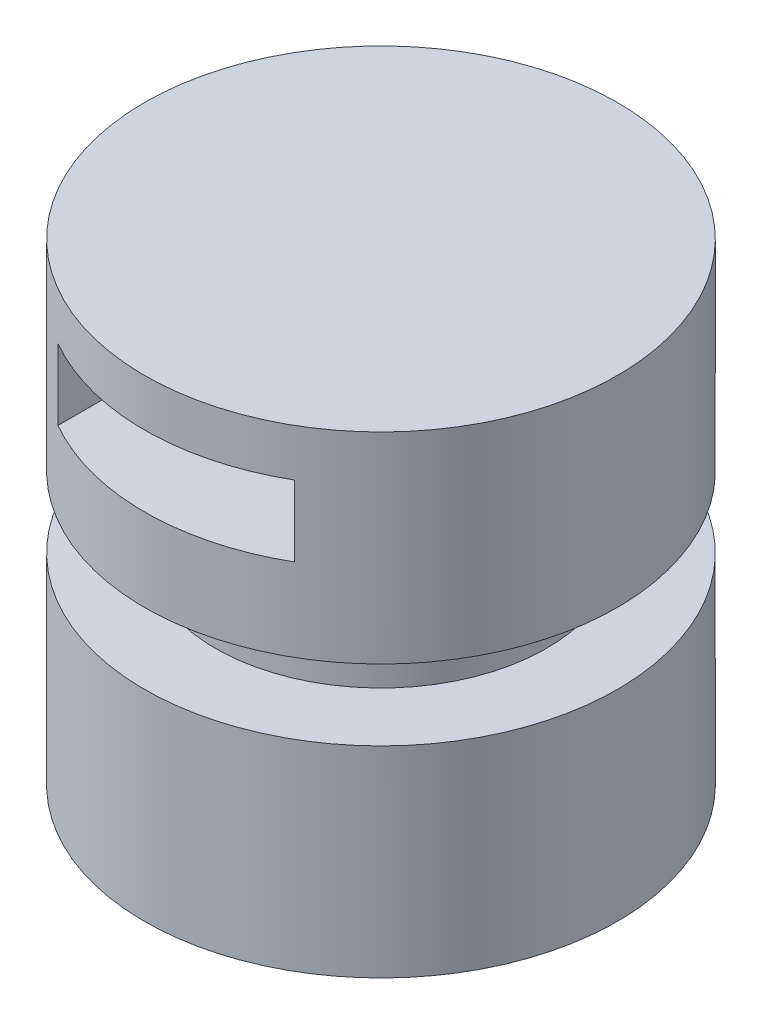
ISO-10303-21;
HEADER;
FILE_DESCRIPTION(('STEP AP214'),'2;1');
FILE_NAME('part.step','',(''),(''),'','','');
FILE_SCHEMA(('AUTOMOTIVE_DESIGN { 1 0 10303 214 1 1 1 1 }'));
ENDSEC;
DATA;
#1=APPLICATION_CONTEXT('core data for automotive mechanical design processes');
#2=APPLICATION_PROTOCOL_DEFINITION('international standard','automotive_design',2000,#1);
#3=PRODUCT_CONTEXT('',#1,'mechanical');
#4=PRODUCT('Part','Part','',(#3));
#5=PRODUCT_RELATED_PRODUCT_CATEGORY('part','',(#4));
#6=PRODUCT_DEFINITION_FORMATION('','',#4);
#7=PRODUCT_DEFINITION_CONTEXT('part definition',#1,'design');
#8=PRODUCT_DEFINITION('design','',#6,#7);
#9=PRODUCT_DEFINITION_SHAPE('','',#8);
#10=(LENGTH_UNIT() NAMED_UNIT(*) SI_UNIT(.MILLI.,.METRE.));
#11=(NAMED_UNIT(*) PLANE_ANGLE_UNIT() SI_UNIT($,.RADIAN.));
#12=(NAMED_UNIT(*) SI_UNIT($,.STERADIAN.) SOLID_ANGLE_UNIT());
#13=UNCERTAINTY_MEASURE_WITH_UNIT(LENGTH_MEASURE(1.E-05),#10,'distance_accuracy_value','');
#14=(GEOMETRIC_REPRESENTATION_CONTEXT(3) GLOBAL_UNCERTAINTY_ASSIGNED_CONTEXT((#13)) GLOBAL_UNIT_ASSIGNED_CONTEXT((#10,
#11,#12)) REPRESENTATION_CONTEXT('',''));
#15=CARTESIAN_POINT('',(0.,0.,0.));
#16=DIRECTION('',(0.,0.,1.));
#17=DIRECTION('',(1.,0.,0.));
#18=AXIS2_PLACEMENT_3D('',#15,#16,#17);
#19=CARTESIAN_POINT('',(0.,200.,0.));
#20=DIRECTION('',(0.,1.,0.));
#21=DIRECTION('',(-1.,0.,0.));
#22=AXIS2_PLACEMENT_3D('',#19,#20,#21);
#23=CYLINDRICAL_SURFACE('',#22,100.);
#24=CARTESIAN_POINT('',(0.,85.,0.));
#25=DIRECTION('',(0.,-1.,0.));
#26=DIRECTION('',(0.,0.,-1.));
#27=AXIS2_PLACEMENT_3D('',#24,#25,#26);
#28=CIRCLE('',#27,100.);
#29=CARTESIAN_POINT('',(0.,85.,-100.));
#30=VERTEX_POINT('',#29);
#31=EDGE_CURVE('E107',#30,#30,#28,.T.);
#32=ORIENTED_EDGE('',*,*,#31,.T.);
#33=EDGE_LOOP('',(#32));
#34=FACE_BOUND('',#33,.T.);
#35=CARTESIAN_POINT('',(0.,0.,0.));
#36=DIRECTION('',(0.,1.,0.));
#37=DIRECTION('',(-1.,0.,0.));
#38=AXIS2_PLACEMENT_3D('',#35,#36,#37);
#39=CIRCLE('',#38,100.);
#40=CARTESIAN_POINT('',(-100.,0.,0.));
#41=VERTEX_POINT('',#40);
#42=EDGE_CURVE('E116',#41,#41,#39,.T.);
#43=ORIENTED_EDGE('',*,*,#42,.T.);
#44=EDGE_LOOP('',(#43));
#45=FACE_BOUND('',#44,.T.);
#46=ADVANCED_FACE('F33',(#34,#45),#23,.T.);
#47=CARTESIAN_POINT('',(0.,0.,0.));
#48=DIRECTION('',(0.,1.,0.));
#49=DIRECTION('',(-1.,0.,0.));
#50=AXIS2_PLACEMENT_3D('',#47,#48,#49);
#51=PLANE('',#50);
#52=ORIENTED_EDGE('',*,*,#42,.F.);
#53=EDGE_LOOP('',(#52));
#54=FACE_BOUND('',#53,.T.);
#55=ADVANCED_FACE('F35',(#54),#51,.F.);
#56=CARTESIAN_POINT('',(0.,0.,0.));
#57=DIRECTION('',(0.,-1.,0.));
#58=DIRECTION('',(0.,0.,-1.));
#59=AXIS2_PLACEMENT_3D('',#56,#57,#58);
#60=CYLINDRICAL_SURFACE('',#59,70.);
#61=CARTESIAN_POINT('',(0.,85.,0.));
#62=DIRECTION('',(0.,-1.,0.));
#63=DIRECTION('',(0.,0.,-1.));
#64=AXIS2_PLACEMENT_3D('',#61,#62,#63);
#65=CIRCLE('',#64,70.);
#66=CARTESIAN_POINT('',(0.,85.,-70.));
#67=VERTEX_POINT('',#66);
#68=EDGE_CURVE('E110',#67,#67,#65,.T.);
#69=ORIENTED_EDGE('',*,*,#68,.F.);
#70=EDGE_LOOP('',(#69));
#71=FACE_BOUND('',#70,.T.);
#72=CARTESIAN_POINT('',(0.,115.,0.));
#73=DIRECTION('',(0.,-1.,0.));
#74=DIRECTION('',(0.,0.,-1.));
#75=AXIS2_PLACEMENT_3D('',#72,#73,#74);
#76=CIRCLE('',#75,70.);
#77=CARTESIAN_POINT('',(0.,115.,-70.));
#78=VERTEX_POINT('',#77);
#79=EDGE_CURVE('E101',#78,#78,#76,.T.);
#80=ORIENTED_EDGE('',*,*,#79,.T.);
#81=EDGE_LOOP('',(#80));
#82=FACE_BOUND('',#81,.T.);
#83=ADVANCED_FACE('F141',(#71,#82),#60,.T.);
#84=CARTESIAN_POINT('',(0.,85.,-70.));
#85=DIRECTION('',(0.,-1.,0.));
#86=DIRECTION('',(0.,0.,-1.));
#87=AXIS2_PLACEMENT_3D('',#84,#85,#86);
#88=PLANE('',#87);
#89=ORIENTED_EDGE('',*,*,#31,.F.);
#90=EDGE_LOOP('',(#89));
#91=FACE_BOUND('',#90,.T.);
#92=ORIENTED_EDGE('',*,*,#68,.T.);
#93=EDGE_LOOP('',(#92));
#94=FACE_BOUND('',#93,.T.);
#95=ADVANCED_FACE('F151',(#91,#94),#88,.F.);
#96=CARTESIAN_POINT('',(0.,115.,-70.));
#97=DIRECTION('',(0.,1.,0.));
#98=DIRECTION('',(0.,0.,1.));
#99=AXIS2_PLACEMENT_3D('',#96,#97,#98);
#100=PLANE('',#99);
#101=ORIENTED_EDGE('',*,*,#79,.F.);
#102=EDGE_LOOP('',(#101));
#103=FACE_BOUND('',#102,.T.);
#104=CARTESIAN_POINT('',(0.,115.,0.));
#105=DIRECTION('',(0.,-1.,0.));
#106=DIRECTION('',(0.,0.,-1.));
#107=AXIS2_PLACEMENT_3D('',#104,#105,#106);
#108=CIRCLE('',#107,100.);
#109=CARTESIAN_POINT('',(0.,115.,-100.));
#110=VERTEX_POINT('',#109);
#111=EDGE_CURVE('E104',#110,#110,#108,.T.);
#112=ORIENTED_EDGE('',*,*,#111,.T.);
#113=EDGE_LOOP('',(#112));
#114=FACE_BOUND('',#113,.T.);
#115=ADVANCED_FACE('F147',(#103,#114),#100,.F.);
#116=CARTESIAN_POINT('',(0.,200.,0.));
#117=DIRECTION('',(0.,-1.,0.));
#118=DIRECTION('',(1.,0.,0.));
#119=AXIS2_PLACEMENT_3D('',#116,#117,#118);
#120=PLANE('',#119);
#121=CARTESIAN_POINT('',(0.,200.,0.));
#122=DIRECTION('',(0.,1.,0.));
#123=DIRECTION('',(-1.,0.,0.));
#124=AXIS2_PLACEMENT_3D('',#121,#122,#123);
#125=CIRCLE('',#124,100.);
#126=CARTESIAN_POINT('',(-100.,200.,0.));
#127=VERTEX_POINT('',#126);
#128=EDGE_CURVE('E113',#127,#127,#125,.T.);
#129=ORIENTED_EDGE('',*,*,#128,.T.);
#130=EDGE_LOOP('',(#129));
#131=FACE_BOUND('',#130,.T.);
#132=ADVANCED_FACE('F133',(#131),#120,.F.);
#133=DIRECTION('',(0.,1.,0.));
#134=VECTOR('',#133,1.);
#135=CARTESIAN_POINT('',(50.,200.,-86.6025403784438));
#136=LINE('',#135,#134);
#137=CARTESIAN_POINT('',(50.,150.,-86.6025403784438));
#138=VERTEX_POINT('',#137);
#139=CARTESIAN_POINT('',(50.,180.,-86.6025403784438));
#140=VERTEX_POINT('',#139);
#141=EDGE_CURVE('E11',#138,#140,#136,.T.);
#142=ORIENTED_EDGE('',*,*,#141,.T.);
#143=CARTESIAN_POINT('',(0.,180.,0.));
#144=DIRECTION('',(0.,1.,0.));
#145=DIRECTION('',(0.,0.,1.));
#146=AXIS2_PLACEMENT_3D('',#143,#144,#145);
#147=CIRCLE('',#146,100.);
#148=CARTESIAN_POINT('',(-50.,180.,-86.6025403784439));
#149=VERTEX_POINT('',#148);
#150=EDGE_CURVE('E81',#140,#149,#147,.T.);
#151=ORIENTED_EDGE('',*,*,#150,.T.);
#152=DIRECTION('',(0.,1.,0.));
#153=VECTOR('',#152,1.);
#154=CARTESIAN_POINT('',(-50.,200.,-86.6025403784439));
#155=LINE('',#154,#153);
#156=CARTESIAN_POINT('',(-50.,150.,-86.6025403784439));
#157=VERTEX_POINT('',#156);
#158=EDGE_CURVE('E79',#149,#157,#155,.F.);
#159=ORIENTED_EDGE('',*,*,#158,.T.);
#160=CARTESIAN_POINT('',(0.,150.,0.));
#161=DIRECTION('',(0.,-1.,0.));
#162=DIRECTION('',(0.,0.,-1.));
#163=AXIS2_PLACEMENT_3D('',#160,#161,#162);
#164=CIRCLE('',#163,100.);
#165=EDGE_CURVE('E74',#157,#138,#164,.T.);
#166=ORIENTED_EDGE('',*,*,#165,.T.);
#167=EDGE_LOOP('',(#142,#151,#159,#166));
#168=FACE_BOUND('',#167,.T.);
#169=CARTESIAN_POINT('',(-50.,180.,86.6025403784439));
#170=VERTEX_POINT('',#169);
#171=CARTESIAN_POINT('',(50.,180.,86.6025403784438));
#172=VERTEX_POINT('',#171);
#173=EDGE_CURVE('E56',#170,#172,#147,.T.);
#174=ORIENTED_EDGE('',*,*,#173,.T.);
#175=DIRECTION('',(0.,1.,0.));
#176=VECTOR('',#175,1.);
#177=CARTESIAN_POINT('',(50.,200.,86.6025403784438));
#178=LINE('',#177,#176);
#179=CARTESIAN_POINT('',(50.,150.,86.6025403784438));
#180=VERTEX_POINT('',#179);
#181=EDGE_CURVE('E41',#172,#180,#178,.F.);
#182=ORIENTED_EDGE('',*,*,#181,.T.);
#183=CARTESIAN_POINT('',(-50.,150.,86.6025403784439));
#184=VERTEX_POINT('',#183);
#185=EDGE_CURVE('E84',#180,#184,#164,.T.);
#186=ORIENTED_EDGE('',*,*,#185,.T.);
#187=DIRECTION('',(0.,1.,0.));
#188=VECTOR('',#187,1.);
#189=CARTESIAN_POINT('',(-50.,200.,86.6025403784439));
#190=LINE('',#189,#188);
#191=EDGE_CURVE('E82',#184,#170,#190,.T.);
#192=ORIENTED_EDGE('',*,*,#191,.T.);
#193=EDGE_LOOP('',(#174,#182,#186,#192));
#194=FACE_BOUND('',#193,.T.);
#195=ORIENTED_EDGE('',*,*,#111,.F.);
#196=EDGE_LOOP('',(#195));
#197=FACE_BOUND('',#196,.T.);
#198=ORIENTED_EDGE('',*,*,#128,.F.);
#199=EDGE_LOOP('',(#198));
#200=FACE_BOUND('',#199,.T.);
#201=ADVANCED_FACE('F76',(#168,#194,#197,#200),#23,.T.);
#202=CARTESIAN_POINT('',(-50.,180.,-100.));
#203=DIRECTION('',(-1.,0.,0.));
#204=DIRECTION('',(0.,-1.,0.));
#205=AXIS2_PLACEMENT_3D('',#202,#203,#204);
#206=PLANE('',#205);
#207=DIRECTION('',(0.,0.,1.));
#208=VECTOR('',#207,1.);
#209=CARTESIAN_POINT('',(-50.,150.,-100.));
#210=LINE('',#209,#208);
#211=EDGE_CURVE('E48',#157,#184,#210,.T.);
#212=ORIENTED_EDGE('',*,*,#211,.F.);
#213=ORIENTED_EDGE('',*,*,#158,.F.);
#214=DIRECTION('',(0.,0.,1.));
#215=VECTOR('',#214,1.);
#216=CARTESIAN_POINT('',(-50.,180.,-100.));
#217=LINE('',#216,#215);
#218=EDGE_CURVE('E96',#149,#170,#217,.T.);
#219=ORIENTED_EDGE('',*,*,#218,.T.);
#220=ORIENTED_EDGE('',*,*,#191,.F.);
#221=EDGE_LOOP('',(#212,#213,#219,#220));
#222=FACE_BOUND('',#221,.T.);
#223=ADVANCED_FACE('F125',(#222),#206,.F.);
#224=CARTESIAN_POINT('',(-50.,180.,-100.));
#225=DIRECTION('',(0.,1.,0.));
#226=DIRECTION('',(0.,0.,1.));
#227=AXIS2_PLACEMENT_3D('',#224,#225,#226);
#228=PLANE('',#227);
#229=DIRECTION('',(0.,0.,1.));
#230=VECTOR('',#229,1.);
#231=CARTESIAN_POINT('',(50.,180.,-100.));
#232=LINE('',#231,#230);
#233=EDGE_CURVE('E92',#140,#172,#232,.T.);
#234=ORIENTED_EDGE('',*,*,#233,.T.);
#235=ORIENTED_EDGE('',*,*,#173,.F.);
#236=ORIENTED_EDGE('',*,*,#218,.F.);
#237=ORIENTED_EDGE('',*,*,#150,.F.);
#238=EDGE_LOOP('',(#234,#235,#236,#237));
#239=FACE_BOUND('',#238,.T.);
#240=ADVANCED_FACE('F123',(#239),#228,.F.);
#241=CARTESIAN_POINT('',(50.,180.,-100.));
#242=DIRECTION('',(1.,0.,0.));
#243=DIRECTION('',(0.,1.,0.));
#244=AXIS2_PLACEMENT_3D('',#241,#242,#243);
#245=PLANE('',#244);
#246=DIRECTION('',(0.,0.,1.));
#247=VECTOR('',#246,1.);
#248=CARTESIAN_POINT('',(50.,150.,-100.));
#249=LINE('',#248,#247);
#250=EDGE_CURVE('E90',#138,#180,#249,.T.);
#251=ORIENTED_EDGE('',*,*,#250,.T.);
#252=ORIENTED_EDGE('',*,*,#181,.F.);
#253=ORIENTED_EDGE('',*,*,#233,.F.);
#254=ORIENTED_EDGE('',*,*,#141,.F.);
#255=EDGE_LOOP('',(#251,#252,#253,#254));
#256=FACE_BOUND('',#255,.T.);
#257=ADVANCED_FACE('F88',(#256),#245,.F.);
#258=CARTESIAN_POINT('',(-50.,150.,-100.));
#259=DIRECTION('',(0.,-1.,0.));
#260=DIRECTION('',(0.,0.,-1.));
#261=AXIS2_PLACEMENT_3D('',#258,#259,#260);
#262=PLANE('',#261);
#263=ORIENTED_EDGE('',*,*,#250,.F.);
#264=ORIENTED_EDGE('',*,*,#165,.F.);
#265=ORIENTED_EDGE('',*,*,#211,.T.);
#266=ORIENTED_EDGE('',*,*,#185,.F.);
#267=EDGE_LOOP('',(#263,#264,#265,#266));
#268=FACE_BOUND('',#267,.T.);
#269=ADVANCED_FACE('F93',(#268),#262,.F.);
#270=CLOSED_SHELL('',(#46,#55,#83,#95,#115,#132,#201,#223,#240,#257,#269));
#271=MANIFOLD_SOLID_BREP('B2',#270);
#272=ADVANCED_BREP_SHAPE_REPRESENTATION('',(#18,#271),#14);
#273=SHAPE_DEFINITION_REPRESENTATION(#9,#272);
ENDSEC;
END-ISO-10303-21;
